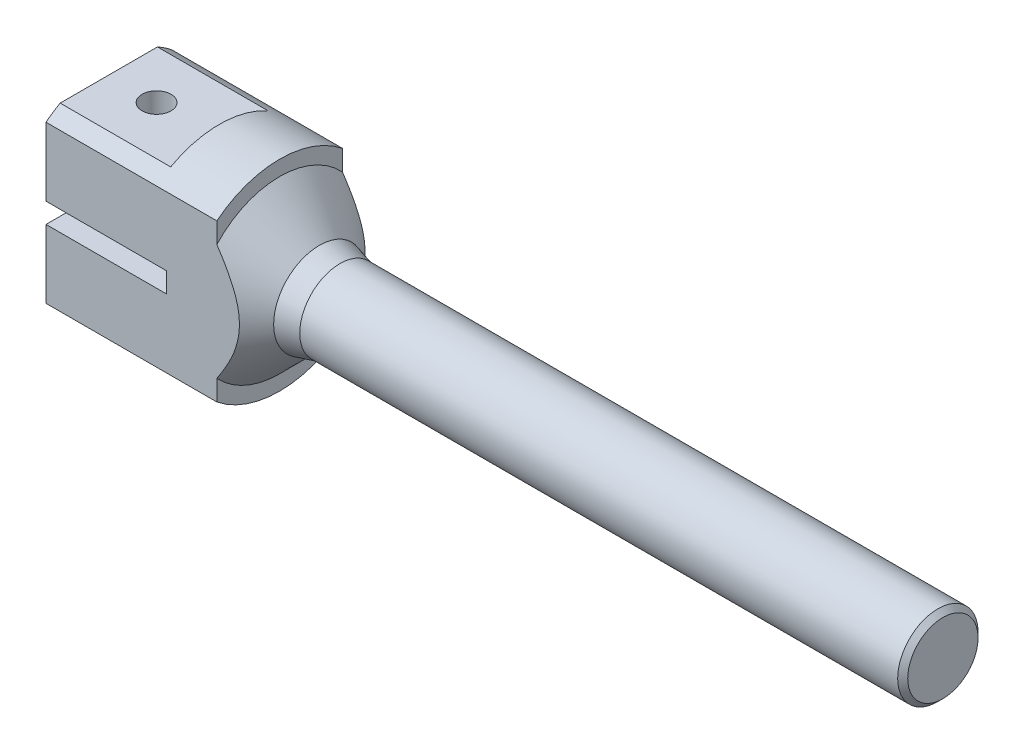
ISO-10303-21;
HEADER;
FILE_DESCRIPTION(('STEP AP214'),'2;1');
FILE_NAME('part.step','',(''),(''),'','','');
FILE_SCHEMA(('AUTOMOTIVE_DESIGN { 1 0 10303 214 1 1 1 1 }'));
ENDSEC;
DATA;
#1=APPLICATION_CONTEXT('core data for automotive mechanical design processes');
#2=APPLICATION_PROTOCOL_DEFINITION('international standard','automotive_design',2000,#1);
#3=PRODUCT_CONTEXT('',#1,'mechanical');
#4=PRODUCT('Part','Part','',(#3));
#5=PRODUCT_RELATED_PRODUCT_CATEGORY('part','',(#4));
#6=PRODUCT_DEFINITION_FORMATION('','',#4);
#7=PRODUCT_DEFINITION_CONTEXT('part definition',#1,'design');
#8=PRODUCT_DEFINITION('design','',#6,#7);
#9=PRODUCT_DEFINITION_SHAPE('','',#8);
#10=(LENGTH_UNIT() NAMED_UNIT(*) SI_UNIT(.MILLI.,.METRE.));
#11=(NAMED_UNIT(*) PLANE_ANGLE_UNIT() SI_UNIT($,.RADIAN.));
#12=(NAMED_UNIT(*) SI_UNIT($,.STERADIAN.) SOLID_ANGLE_UNIT());
#13=UNCERTAINTY_MEASURE_WITH_UNIT(LENGTH_MEASURE(1.E-05),#10,'distance_accuracy_value','');
#14=(GEOMETRIC_REPRESENTATION_CONTEXT(3) GLOBAL_UNCERTAINTY_ASSIGNED_CONTEXT((#13)) GLOBAL_UNIT_ASSIGNED_CONTEXT((#10,
#11,#12)) REPRESENTATION_CONTEXT('',''));
#15=CARTESIAN_POINT('',(0.,0.,0.));
#16=DIRECTION('',(0.,0.,1.));
#17=DIRECTION('',(1.,0.,0.));
#18=AXIS2_PLACEMENT_3D('',#15,#16,#17);
#19=CARTESIAN_POINT('',(-132.,20.,0.));
#20=DIRECTION('',(-1.,0.,0.));
#21=DIRECTION('',(0.,0.,1.));
#22=AXIS2_PLACEMENT_3D('',#19,#20,#21);
#23=PLANE('',#22);
#24=CARTESIAN_POINT('',(-132.,0.,0.));
#25=DIRECTION('',(-1.,0.,0.));
#26=DIRECTION('',(0.,0.,1.));
#27=AXIS2_PLACEMENT_3D('',#24,#25,#26);
#28=CIRCLE('',#27,20.);
#29=CARTESIAN_POINT('',(-132.,-15.612494995996,-12.5));
#30=VERTEX_POINT('',#29);
#31=CARTESIAN_POINT('',(-132.,-15.612494995996,12.5));
#32=VERTEX_POINT('',#31);
#33=EDGE_CURVE('E169',#30,#32,#28,.T.);
#34=ORIENTED_EDGE('',*,*,#33,.F.);
#35=DIRECTION('',(0.,1.,0.));
#36=VECTOR('',#35,1.);
#37=CARTESIAN_POINT('',(-132.,20.,-12.5));
#38=LINE('',#37,#36);
#39=CARTESIAN_POINT('',(-132.,-11.5217186218029,-12.5));
#40=VERTEX_POINT('',#39);
#41=EDGE_CURVE('E142',#30,#40,#38,.T.);
#42=ORIENTED_EDGE('',*,*,#41,.T.);
#43=CARTESIAN_POINT('',(-132.,0.,0.));
#44=DIRECTION('',(-1.,0.,0.));
#45=DIRECTION('',(0.,0.,1.));
#46=AXIS2_PLACEMENT_3D('',#43,#44,#45);
#47=CIRCLE('',#46,17.);
#48=CARTESIAN_POINT('',(-132.,-11.5217186218029,12.5));
#49=VERTEX_POINT('',#48);
#50=EDGE_CURVE('E277',#40,#49,#47,.T.);
#51=ORIENTED_EDGE('',*,*,#50,.T.);
#52=DIRECTION('',(0.,-1.,0.));
#53=VECTOR('',#52,1.);
#54=CARTESIAN_POINT('',(-132.,20.,12.5));
#55=LINE('',#54,#53);
#56=EDGE_CURVE('E212',#49,#32,#55,.T.);
#57=ORIENTED_EDGE('',*,*,#56,.T.);
#58=EDGE_LOOP('',(#34,#42,#51,#57));
#59=FACE_BOUND('',#58,.T.);
#60=ADVANCED_FACE('F37',(#59),#23,.F.);
#61=CARTESIAN_POINT('',(0.,0.,0.));
#62=DIRECTION('',(-1.,0.,0.));
#63=DIRECTION('',(0.,0.,1.));
#64=AXIS2_PLACEMENT_3D('',#61,#62,#63);
#65=CYLINDRICAL_SURFACE('',#64,20.);
#66=CARTESIAN_POINT('',(-132.,15.612494995996,12.5));
#67=VERTEX_POINT('',#66);
#68=CARTESIAN_POINT('',(-132.,15.612494995996,-12.5));
#69=VERTEX_POINT('',#68);
#70=EDGE_CURVE('E282',#67,#69,#28,.T.);
#71=ORIENTED_EDGE('',*,*,#70,.T.);
#72=DIRECTION('',(-1.,0.,0.));
#73=VECTOR('',#72,1.);
#74=CARTESIAN_POINT('',(0.,15.612494995996,-12.5));
#75=LINE('',#74,#73);
#76=CARTESIAN_POINT('',(-166.,15.612494995996,-12.5));
#77=VERTEX_POINT('',#76);
#78=EDGE_CURVE('E246',#69,#77,#75,.T.);
#79=ORIENTED_EDGE('',*,*,#78,.T.);
#80=CARTESIAN_POINT('',(-166.,0.,0.));
#81=DIRECTION('',(-1.,0.,0.));
#82=DIRECTION('',(0.,0.,1.));
#83=AXIS2_PLACEMENT_3D('',#80,#81,#82);
#84=CIRCLE('',#83,20.);
#85=CARTESIAN_POINT('',(-166.,17.5,-9.68245836551854));
#86=VERTEX_POINT('',#85);
#87=EDGE_CURVE('E164',#86,#77,#84,.T.);
#88=ORIENTED_EDGE('',*,*,#87,.F.);
#89=DIRECTION('',(-1.,0.,0.));
#90=VECTOR('',#89,1.);
#91=CARTESIAN_POINT('',(0.,17.5,-9.68245836551854));
#92=LINE('',#91,#90);
#93=CARTESIAN_POINT('',(-144.,17.5,-9.68245836551854));
#94=VERTEX_POINT('',#93);
#95=EDGE_CURVE('E180',#86,#94,#92,.F.);
#96=ORIENTED_EDGE('',*,*,#95,.T.);
#97=CARTESIAN_POINT('',(-144.,0.,0.));
#98=DIRECTION('',(1.,0.,0.));
#99=DIRECTION('',(0.,0.,-1.));
#100=AXIS2_PLACEMENT_3D('',#97,#98,#99);
#101=CIRCLE('',#100,20.);
#102=CARTESIAN_POINT('',(-144.,17.5,9.68245836551854));
#103=VERTEX_POINT('',#102);
#104=EDGE_CURVE('E288',#94,#103,#101,.T.);
#105=ORIENTED_EDGE('',*,*,#104,.T.);
#106=DIRECTION('',(-1.,0.,0.));
#107=VECTOR('',#106,1.);
#108=CARTESIAN_POINT('',(0.,17.5,9.68245836551854));
#109=LINE('',#108,#107);
#110=CARTESIAN_POINT('',(-166.,17.5,9.68245836551854));
#111=VERTEX_POINT('',#110);
#112=EDGE_CURVE('E173',#103,#111,#109,.T.);
#113=ORIENTED_EDGE('',*,*,#112,.T.);
#114=CARTESIAN_POINT('',(-166.,15.612494995996,12.5));
#115=VERTEX_POINT('',#114);
#116=EDGE_CURVE('E167',#115,#111,#84,.T.);
#117=ORIENTED_EDGE('',*,*,#116,.F.);
#118=DIRECTION('',(-1.,0.,0.));
#119=VECTOR('',#118,1.);
#120=CARTESIAN_POINT('',(0.,15.612494995996,12.5));
#121=LINE('',#120,#119);
#122=EDGE_CURVE('E492',#115,#67,#121,.F.);
#123=ORIENTED_EDGE('',*,*,#122,.T.);
#124=EDGE_LOOP('',(#71,#79,#88,#96,#105,#113,#117,#123));
#125=FACE_BOUND('',#124,.T.);
#126=ADVANCED_FACE('F258',(#125),#65,.T.);
#127=CARTESIAN_POINT('',(-166.,20.,0.));
#128=DIRECTION('',(1.,0.,0.));
#129=DIRECTION('',(0.,0.,-1.));
#130=AXIS2_PLACEMENT_3D('',#127,#128,#129);
#131=PLANE('',#130);
#132=ORIENTED_EDGE('',*,*,#87,.T.);
#133=DIRECTION('',(0.,1.,0.));
#134=VECTOR('',#133,1.);
#135=CARTESIAN_POINT('',(-166.,-20.,-12.5));
#136=LINE('',#135,#134);
#137=CARTESIAN_POINT('',(-166.,1.99999999999998,-12.5));
#138=VERTEX_POINT('',#137);
#139=EDGE_CURVE('E158',#138,#77,#136,.T.);
#140=ORIENTED_EDGE('',*,*,#139,.F.);
#141=DIRECTION('',(0.,0.,1.));
#142=VECTOR('',#141,1.);
#143=CARTESIAN_POINT('',(-166.,1.99999999999998,0.));
#144=LINE('',#143,#142);
#145=CARTESIAN_POINT('',(-166.,1.99999999999998,12.5));
#146=VERTEX_POINT('',#145);
#147=EDGE_CURVE('E291',#138,#146,#144,.T.);
#148=ORIENTED_EDGE('',*,*,#147,.T.);
#149=DIRECTION('',(0.,1.,0.));
#150=VECTOR('',#149,1.);
#151=CARTESIAN_POINT('',(-166.,-20.,12.5));
#152=LINE('',#151,#150);
#153=EDGE_CURVE('E498',#146,#115,#152,.T.);
#154=ORIENTED_EDGE('',*,*,#153,.T.);
#155=ORIENTED_EDGE('',*,*,#116,.T.);
#156=DIRECTION('',(0.,0.,-1.));
#157=VECTOR('',#156,1.);
#158=CARTESIAN_POINT('',(-166.,17.5,0.));
#159=LINE('',#158,#157);
#160=EDGE_CURVE('E286',#111,#86,#159,.T.);
#161=ORIENTED_EDGE('',*,*,#160,.T.);
#162=EDGE_LOOP('',(#132,#140,#148,#154,#155,#161));
#163=FACE_BOUND('',#162,.T.);
#164=ADVANCED_FACE('F263',(#163),#131,.F.);
#165=CARTESIAN_POINT('',(0.,0.,0.));
#166=DIRECTION('',(-1.,0.,0.));
#167=DIRECTION('',(0.,0.,1.));
#168=AXIS2_PLACEMENT_3D('',#165,#166,#167);
#169=PLANE('',#168);
#170=CARTESIAN_POINT('',(0.,0.,0.));
#171=DIRECTION('',(-1.,0.,0.));
#172=DIRECTION('',(0.,0.,1.));
#173=AXIS2_PLACEMENT_3D('',#170,#171,#172);
#174=CIRCLE('',#173,7.00000000000002);
#175=CARTESIAN_POINT('',(0.,0.,7.00000000000002));
#176=VERTEX_POINT('',#175);
#177=EDGE_CURVE('E11',#176,#176,#174,.F.);
#178=ORIENTED_EDGE('',*,*,#177,.T.);
#179=EDGE_LOOP('',(#178));
#180=FACE_BOUND('',#179,.T.);
#181=ADVANCED_FACE('F310',(#180),#169,.F.);
#182=CARTESIAN_POINT('',(0.,0.,0.));
#183=DIRECTION('',(-1.,0.,0.));
#184=DIRECTION('',(0.,0.,1.));
#185=AXIS2_PLACEMENT_3D('',#182,#183,#184);
#186=CYLINDRICAL_SURFACE('',#185,7.99999999999999);
#187=CARTESIAN_POINT('',(-0.999999999999961,0.,0.));
#188=DIRECTION('',(-1.,0.,0.));
#189=DIRECTION('',(0.,0.,1.));
#190=AXIS2_PLACEMENT_3D('',#187,#188,#189);
#191=CIRCLE('',#190,7.99999999999999);
#192=CARTESIAN_POINT('',(-0.999999999999961,0.,7.99999999999999));
#193=VERTEX_POINT('',#192);
#194=EDGE_CURVE('E45',#193,#193,#191,.T.);
#195=ORIENTED_EDGE('',*,*,#194,.T.);
#196=EDGE_LOOP('',(#195));
#197=FACE_BOUND('',#196,.T.);
#198=CARTESIAN_POINT('',(-120.,0.,0.));
#199=DIRECTION('',(-1.,0.,0.));
#200=DIRECTION('',(0.,0.,1.));
#201=AXIS2_PLACEMENT_3D('',#198,#199,#200);
#202=CIRCLE('',#201,7.99999999999999);
#203=CARTESIAN_POINT('',(-120.,0.,7.99999999999999));
#204=VERTEX_POINT('',#203);
#205=EDGE_CURVE('E280',#204,#204,#202,.T.);
#206=ORIENTED_EDGE('',*,*,#205,.F.);
#207=EDGE_LOOP('',(#206));
#208=FACE_BOUND('',#207,.T.);
#209=ADVANCED_FACE('F306',(#197,#208),#186,.T.);
#210=CARTESIAN_POINT('',(-120.,0.,0.));
#211=DIRECTION('',(-1.,0.,0.));
#212=DIRECTION('',(0.,0.,1.));
#213=AXIS2_PLACEMENT_3D('',#210,#211,#212);
#214=CONICAL_SURFACE('',#213,7.99999999999999,0.261799387799149);
#215=CARTESIAN_POINT('',(-124.098076211353,0.,0.));
#216=DIRECTION('',(-1.,0.,0.));
#217=DIRECTION('',(0.,0.,1.));
#218=AXIS2_PLACEMENT_3D('',#215,#216,#217);
#219=CIRCLE('',#218,9.09807621135329);
#220=CARTESIAN_POINT('',(-124.098076211353,0.,9.09807621135329));
#221=VERTEX_POINT('',#220);
#222=EDGE_CURVE('E276',#221,#221,#219,.T.);
#223=ORIENTED_EDGE('',*,*,#222,.F.);
#224=EDGE_LOOP('',(#223));
#225=FACE_BOUND('',#224,.T.);
#226=ORIENTED_EDGE('',*,*,#205,.T.);
#227=EDGE_LOOP('',(#226));
#228=FACE_BOUND('',#227,.T.);
#229=ADVANCED_FACE('F233',(#225,#228),#214,.T.);
#230=CARTESIAN_POINT('',(-124.098076211353,0.,0.));
#231=DIRECTION('',(-1.,0.,0.));
#232=DIRECTION('',(0.,0.,1.));
#233=AXIS2_PLACEMENT_3D('',#230,#231,#232);
#234=CONICAL_SURFACE('',#233,9.09807621135329,0.785398163397447);
#235=ORIENTED_EDGE('',*,*,#50,.F.);
#236=CARTESIAN_POINT('',(-142.582505164002,-24.5874885078206,-12.5));
#237=CARTESIAN_POINT('',(-142.329912459532,-24.3041242255394,-12.5));
#238=CARTESIAN_POINT('',(-142.077816178034,-24.0203175125965,-12.5));
#239=CARTESIAN_POINT('',(-141.574724222286,-23.4517278552672,-12.5));
#240=CARTESIAN_POINT('',(-141.323728553534,-23.1669449060179,-12.5));
#241=CARTESIAN_POINT('',(-140.572509072094,-22.3109432741144,-12.5));
#242=CARTESIAN_POINT('',(-140.074102067927,-21.7381270120877,-12.5));
#243=CARTESIAN_POINT('',(-139.081202170822,-20.5849628650982,-12.5));
#244=CARTESIAN_POINT('',(-138.586734070123,-20.0045936013638,-12.5));
#245=CARTESIAN_POINT('',(-137.605368559102,-18.8375271612757,-12.5));
#246=CARTESIAN_POINT('',(-137.118470799965,-18.2508302785989,-12.5));
#247=CARTESIAN_POINT('',(-136.126326363579,-17.0353272930719,-12.5));
#248=CARTESIAN_POINT('',(-135.621652146903,-16.406051669597,-12.5));
#249=CARTESIAN_POINT('',(-134.875311483112,-15.4536941518269,-12.5));
#250=CARTESIAN_POINT('',(-134.628289339896,-15.1348070720314,-12.5));
#251=CARTESIAN_POINT('',(-134.138414100918,-14.4938495911741,-12.5));
#252=CARTESIAN_POINT('',(-133.89556093604,-14.1717792430264,-12.5));
#253=CARTESIAN_POINT('',(-133.415136318841,-13.5245766510037,-12.5));
#254=CARTESIAN_POINT('',(-133.177556501627,-13.1994506252805,-12.5));
#255=CARTESIAN_POINT('',(-132.708121118201,-12.5450994433125,-12.5));
#256=CARTESIAN_POINT('',(-132.476265369085,-12.2158744185509,-12.5));
#257=CARTESIAN_POINT('',(-132.019400181657,-11.5528222598379,-12.5));
#258=CARTESIAN_POINT('',(-131.794389014199,-11.2189963197068,-12.5));
#259=CARTESIAN_POINT('',(-131.352495723505,-10.5460207446593,-12.5));
#260=CARTESIAN_POINT('',(-131.135613000047,-10.2068715054602,-12.5));
#261=CARTESIAN_POINT('',(-130.773695369621,-9.62265647304877,-12.5));
#262=CARTESIAN_POINT('',(-130.62621142329,-9.37910803158632,-12.5));
#263=CARTESIAN_POINT('',(-130.336866991398,-8.88868397830298,-12.5));
#264=CARTESIAN_POINT('',(-130.195006522398,-8.64180835668681,-12.5));
#265=CARTESIAN_POINT('',(-129.917700475652,-8.14435030913598,-12.5));
#266=CARTESIAN_POINT('',(-129.782257299854,-7.89376654060751,-12.5));
#267=CARTESIAN_POINT('',(-129.518831578052,-7.38870084629237,-12.5));
#268=CARTESIAN_POINT('',(-129.390848989258,-7.13421894287371,-12.5));
#269=CARTESIAN_POINT('',(-129.144515414876,-6.62321633491315,-12.5));
#270=CARTESIAN_POINT('',(-129.026093144495,-6.36673021666942,-12.5));
#271=CARTESIAN_POINT('',(-128.798999785147,-5.84948018376722,-12.5));
#272=CARTESIAN_POINT('',(-128.690329447263,-5.58871594143925,-12.5));
#273=CARTESIAN_POINT('',(-128.381215160915,-4.80006408068157,-12.5));
#274=CARTESIAN_POINT('',(-128.197442420802,-4.265360547229,-12.5));
#275=CARTESIAN_POINT('',(-127.938587461919,-3.35838428046543,-12.5));
#276=CARTESIAN_POINT('',(-127.847642537237,-2.99062156549364,-12.5));
#277=CARTESIAN_POINT('',(-127.695516970047,-2.24893926251387,-12.5));
#278=CARTESIAN_POINT('',(-127.634331247564,-1.87502073659379,-12.5));
#279=CARTESIAN_POINT('',(-127.544946982688,-1.12432150052163,-12.5));
#280=CARTESIAN_POINT('',(-127.516652171986,-0.747552408489459,-12.5));
#281=CARTESIAN_POINT('',(-127.4943131528,0.00702119526327052,-12.5));
#282=CARTESIAN_POINT('',(-127.500269123276,0.384825712383575,-12.5));
#283=CARTESIAN_POINT('',(-127.546056730479,1.13781636111397,-12.5));
#284=CARTESIAN_POINT('',(-127.585841475339,1.51300539274105,-12.5));
#285=CARTESIAN_POINT('',(-127.697060799547,2.25861858885501,-12.5));
#286=CARTESIAN_POINT('',(-127.768497789433,2.62904238822501,-12.5));
#287=CARTESIAN_POINT('',(-127.939950415408,3.36464694696357,-12.5));
#288=CARTESIAN_POINT('',(-128.040075962913,3.72980175736228,-12.5));
#289=CARTESIAN_POINT('',(-128.264834560528,4.45239340598112,-12.5));
#290=CARTESIAN_POINT('',(-128.389467636655,4.80983023600706,-12.5));
#291=CARTESIAN_POINT('',(-128.698235536143,5.61862061589263,-12.5));
#292=CARTESIAN_POINT('',(-128.889168301244,6.06736587317811,-12.5));
#293=CARTESIAN_POINT('',(-129.298007455178,6.95249884373674,-12.5));
#294=CARTESIAN_POINT('',(-129.515927941464,7.3888799509199,-12.5));
#295=CARTESIAN_POINT('',(-129.973268938627,8.25122020991313,-12.5));
#296=CARTESIAN_POINT('',(-130.212730165694,8.67715760260757,-12.5));
#297=CARTESIAN_POINT('',(-130.708213487528,9.51912653534905,-12.5));
#298=CARTESIAN_POINT('',(-130.964232830318,9.93515970584469,-12.5));
#299=CARTESIAN_POINT('',(-131.493180370554,10.7646879124833,-12.5));
#300=CARTESIAN_POINT('',(-131.766297998893,11.178061597253,-12.5));
#301=CARTESIAN_POINT('',(-132.323350097896,11.997445029019,-12.5));
#302=CARTESIAN_POINT('',(-132.607284916273,12.4034545386766,-12.5));
#303=CARTESIAN_POINT('',(-133.183546751092,13.2087228694566,-12.5));
#304=CARTESIAN_POINT('',(-133.475863301205,13.6079891983621,-12.5));
#305=CARTESIAN_POINT('',(-133.919680659868,14.2028764454326,-12.5));
#306=CARTESIAN_POINT('',(-134.068508081135,14.4005007486582,-12.5));
#307=CARTESIAN_POINT('',(-134.367788486296,14.7945141309476,-12.5));
#308=CARTESIAN_POINT('',(-134.518241466401,14.990903212888,-12.5));
#309=CARTESIAN_POINT('',(-135.029239690881,15.6527406738963,-12.5));
#310=CARTESIAN_POINT('',(-135.393225678115,16.1155355133311,-12.5));
#311=CARTESIAN_POINT('',(-136.127943701348,17.0357466132561,-12.5));
#312=CARTESIAN_POINT('',(-136.498675956736,17.49316269803,-12.5));
#313=CARTESIAN_POINT('',(-137.245709445989,18.4035119983837,-12.5));
#314=CARTESIAN_POINT('',(-137.622011347707,18.8564446653141,-12.5));
#315=CARTESIAN_POINT('',(-138.379190829643,19.7584566263159,-12.5));
#316=CARTESIAN_POINT('',(-138.760068366539,20.2075359568015,-12.5));
#317=CARTESIAN_POINT('',(-139.525815420376,21.1025908052566,-12.5));
#318=CARTESIAN_POINT('',(-139.910686493325,21.548564990893,-12.5));
#319=CARTESIAN_POINT('',(-140.683683047194,22.4376854653776,-12.5));
#320=CARTESIAN_POINT('',(-141.07180854673,22.8808317380246,-12.5));
#321=CARTESIAN_POINT('',(-142.240338586266,24.2066323407367,-12.5));
#322=CARTESIAN_POINT('',(-143.024886572368,25.0856367093792,-12.5));
#323=CARTESIAN_POINT('',(-144.208653984623,26.3994562108111,-12.5));
#324=CARTESIAN_POINT('',(-144.604801008235,26.8370508519435,-12.5));
#325=CARTESIAN_POINT('',(-145.398904702695,27.7105861183492,-12.5));
#326=CARTESIAN_POINT('',(-145.796861350966,28.1465267641351,-12.5));
#327=CARTESIAN_POINT('',(-146.993117907138,29.4521896937749,-12.5));
#328=CARTESIAN_POINT('',(-147.793790770945,30.3197378463011,-12.5));
#329=CARTESIAN_POINT('',(-149.399864489899,32.050024919012,-12.5));
#330=CARTESIAN_POINT('',(-150.205264074315,32.9127650202052,-12.5));
#331=CARTESIAN_POINT('',(-151.820001056577,34.6345429733566,-12.5));
#332=CARTESIAN_POINT('',(-152.629338437169,35.4935808415052,-12.5));
#333=CARTESIAN_POINT('',(-154.870339327525,37.8633977717932,-12.5));
#334=CARTESIAN_POINT('',(-156.305350624908,39.3710102980744,-12.5));
#335=CARTESIAN_POINT('',(-159.182484336396,42.3796467413485,-12.5));
#336=CARTESIAN_POINT('',(-160.624607289065,43.8806701425586,-12.5));
#337=CARTESIAN_POINT('',(-163.50906807521,46.8725603224486,-12.5));
#338=CARTESIAN_POINT('',(-164.951388099977,48.3634442773318,-12.5));
#339=CARTESIAN_POINT('',(-167.117742705545,50.5968542784499,-12.5));
#340=CARTESIAN_POINT('',(-167.840308600896,51.3408060870532,-12.5));
#341=CARTESIAN_POINT('',(-169.286308153613,52.8278649098813,-12.5));
#342=CARTESIAN_POINT('',(-170.009741810359,53.5709719247096,-12.5));
#343=CARTESIAN_POINT('',(-170.73355429671,54.3137098212256,-12.5));
#344=B_SPLINE_CURVE_WITH_KNOTS('',3,(#236,#237,#238,#239,#240,#241,#242,#243,#244,#245,#246,
#247,#248,#249,#250,#251,#252,#253,#254,#255,#256,#257,#258,#259,#260,#261,#262,#263,#264,#265,
#266,#267,#268,#269,#270,#271,#272,#273,#274,#275,#276,#277,#278,#279,#280,#281,#282,#283,#284,
#285,#286,#287,#288,#289,#290,#291,#292,#293,#294,#295,#296,#297,#298,#299,#300,#301,#302,#303,
#304,#305,#306,#307,#308,#309,#310,#311,#312,#313,#314,#315,#316,#317,#318,#319,#320,#321,#322,
#323,#324,#325,#326,#327,#328,#329,#330,#331,#332,#333,#334,#335,#336,#337,#338,#339,#340,#341,
#342,#343),.UNSPECIFIED.,.F.,.F.,(4,2,2,2,2,2,2,2,2,2,2,2,2,2,2,2,2,2,2,2,2,2,2,2,2,2,2,2,2,2,2,
2,2,2,2,2,2,2,2,2,2,2,2,2,2,2,2,2,2,2,2,2,2,4),(0.,1.1388078034594,2.27762128804384,
4.55547025978992,6.84276236047884,9.1299487565436,11.5497183812274,12.7598071460397,
13.9698758297192,15.1778635207777,16.3858125626454,17.5934538625367,18.8010058113829,
19.6551125618412,20.5092218273567,21.3636482945591,22.2180698607832,23.065381601155,
23.9127585445233,25.6059881659704,26.7414941819285,27.8768062958662,29.008787034134,
30.1407736869643,31.2711937858895,32.4016999889513,33.5365966591332,34.6714945341756,
36.1333348813379,37.5959420900476,39.0613744580908,40.5265638924005,42.0127036507536,
43.4988912207943,44.9832975240624,45.7254798992265,46.4676605454252,48.2339199669056,
50.0002369301062,51.7667674350425,53.5332812278315,55.3005112884846,57.0677514645852,
60.6022782772259,62.3730929132289,64.1438855156707,67.6855318478711,71.2262660801863,
74.7669848125395,81.0110962651543,87.2556880759125,93.4787960195283,96.5900801196453,
99.70136199629),.UNSPECIFIED.);
#345=CARTESIAN_POINT('',(-132.,11.5217186218029,-12.5));
#346=VERTEX_POINT('',#345);
#347=EDGE_CURVE('E239',#40,#346,#344,.T.);
#348=ORIENTED_EDGE('',*,*,#347,.T.);
#349=CARTESIAN_POINT('',(-132.,11.5217186218029,12.5));
#350=VERTEX_POINT('',#349);
#351=EDGE_CURVE('E273',#350,#346,#47,.T.);
#352=ORIENTED_EDGE('',*,*,#351,.F.);
#353=CARTESIAN_POINT('',(-142.582505164002,-24.5874885078206,12.5));
#354=CARTESIAN_POINT('',(-142.329912459532,-24.3041242255394,12.5));
#355=CARTESIAN_POINT('',(-142.077816178034,-24.0203175125965,12.5));
#356=CARTESIAN_POINT('',(-141.574724222286,-23.4517278552672,12.5));
#357=CARTESIAN_POINT('',(-141.323728553534,-23.1669449060179,12.5));
#358=CARTESIAN_POINT('',(-140.572509072094,-22.3109432741144,12.5));
#359=CARTESIAN_POINT('',(-140.074102067927,-21.7381270120877,12.5));
#360=CARTESIAN_POINT('',(-139.081202170822,-20.5849628650982,12.5));
#361=CARTESIAN_POINT('',(-138.586734070123,-20.0045936013638,12.5));
#362=CARTESIAN_POINT('',(-137.605368559102,-18.8375271612757,12.5));
#363=CARTESIAN_POINT('',(-137.118470799965,-18.2508302785989,12.5));
#364=CARTESIAN_POINT('',(-136.126326363579,-17.0353272930719,12.5));
#365=CARTESIAN_POINT('',(-135.621652146903,-16.406051669597,12.5));
#366=CARTESIAN_POINT('',(-134.875311483112,-15.4536941518269,12.5));
#367=CARTESIAN_POINT('',(-134.628289339896,-15.1348070720314,12.5));
#368=CARTESIAN_POINT('',(-134.138414100918,-14.4938495911741,12.5));
#369=CARTESIAN_POINT('',(-133.89556093604,-14.1717792430264,12.5));
#370=CARTESIAN_POINT('',(-133.415136318841,-13.5245766510037,12.5));
#371=CARTESIAN_POINT('',(-133.177556501627,-13.1994506252805,12.5));
#372=CARTESIAN_POINT('',(-132.708121118201,-12.5450994433125,12.5));
#373=CARTESIAN_POINT('',(-132.476265369085,-12.2158744185509,12.5));
#374=CARTESIAN_POINT('',(-132.019400181657,-11.5528222598379,12.5));
#375=CARTESIAN_POINT('',(-131.794389014199,-11.2189963197068,12.5));
#376=CARTESIAN_POINT('',(-131.352495723505,-10.5460207446593,12.5));
#377=CARTESIAN_POINT('',(-131.135613000047,-10.2068715054602,12.5));
#378=CARTESIAN_POINT('',(-130.773695369621,-9.62265647304877,12.5));
#379=CARTESIAN_POINT('',(-130.62621142329,-9.37910803158632,12.5));
#380=CARTESIAN_POINT('',(-130.336866991398,-8.88868397830298,12.5));
#381=CARTESIAN_POINT('',(-130.195006522398,-8.64180835668681,12.5));
#382=CARTESIAN_POINT('',(-129.917700475652,-8.14435030913598,12.5));
#383=CARTESIAN_POINT('',(-129.782257299854,-7.89376654060751,12.5));
#384=CARTESIAN_POINT('',(-129.518831578052,-7.38870084629237,12.5));
#385=CARTESIAN_POINT('',(-129.390848989258,-7.13421894287371,12.5));
#386=CARTESIAN_POINT('',(-129.144515414876,-6.62321633491315,12.5));
#387=CARTESIAN_POINT('',(-129.026093144495,-6.36673021666942,12.5));
#388=CARTESIAN_POINT('',(-128.798999785147,-5.84948018376722,12.5));
#389=CARTESIAN_POINT('',(-128.690329447263,-5.58871594143925,12.5));
#390=CARTESIAN_POINT('',(-128.381215160915,-4.80006408068157,12.5));
#391=CARTESIAN_POINT('',(-128.197442420802,-4.265360547229,12.5));
#392=CARTESIAN_POINT('',(-127.938587461919,-3.35838428046543,12.5));
#393=CARTESIAN_POINT('',(-127.847642537237,-2.99062156549364,12.5));
#394=CARTESIAN_POINT('',(-127.695516970047,-2.24893926251387,12.5));
#395=CARTESIAN_POINT('',(-127.634331247564,-1.87502073659379,12.5));
#396=CARTESIAN_POINT('',(-127.544946982688,-1.12432150052163,12.5));
#397=CARTESIAN_POINT('',(-127.516652171986,-0.747552408489459,12.5));
#398=CARTESIAN_POINT('',(-127.4943131528,0.00702119526327052,12.5));
#399=CARTESIAN_POINT('',(-127.500269123276,0.384825712383575,12.5));
#400=CARTESIAN_POINT('',(-127.546056730479,1.13781636111397,12.5));
#401=CARTESIAN_POINT('',(-127.585841475339,1.51300539274105,12.5));
#402=CARTESIAN_POINT('',(-127.697060799547,2.25861858885501,12.5));
#403=CARTESIAN_POINT('',(-127.768497789433,2.62904238822501,12.5));
#404=CARTESIAN_POINT('',(-127.939950415408,3.36464694696357,12.5));
#405=CARTESIAN_POINT('',(-128.040075962913,3.72980175736228,12.5));
#406=CARTESIAN_POINT('',(-128.264834560528,4.45239340598112,12.5));
#407=CARTESIAN_POINT('',(-128.389467636655,4.80983023600706,12.5));
#408=CARTESIAN_POINT('',(-128.698235536143,5.61862061589263,12.5));
#409=CARTESIAN_POINT('',(-128.889168301244,6.06736587317811,12.5));
#410=CARTESIAN_POINT('',(-129.298007455178,6.95249884373674,12.5));
#411=CARTESIAN_POINT('',(-129.515927941464,7.3888799509199,12.5));
#412=CARTESIAN_POINT('',(-129.973268938627,8.25122020991313,12.5));
#413=CARTESIAN_POINT('',(-130.212730165694,8.67715760260757,12.5));
#414=CARTESIAN_POINT('',(-130.708213487528,9.51912653534905,12.5));
#415=CARTESIAN_POINT('',(-130.964232830318,9.93515970584469,12.5));
#416=CARTESIAN_POINT('',(-131.493180370554,10.7646879124833,12.5));
#417=CARTESIAN_POINT('',(-131.766297998893,11.178061597253,12.5));
#418=CARTESIAN_POINT('',(-132.323350097896,11.997445029019,12.5));
#419=CARTESIAN_POINT('',(-132.607284916273,12.4034545386766,12.5));
#420=CARTESIAN_POINT('',(-133.183546751092,13.2087228694566,12.5));
#421=CARTESIAN_POINT('',(-133.475863301205,13.6079891983621,12.5));
#422=CARTESIAN_POINT('',(-133.919680659868,14.2028764454326,12.5));
#423=CARTESIAN_POINT('',(-134.068508081135,14.4005007486582,12.5));
#424=CARTESIAN_POINT('',(-134.367788486296,14.7945141309476,12.5));
#425=CARTESIAN_POINT('',(-134.518241466401,14.990903212888,12.5));
#426=CARTESIAN_POINT('',(-135.029239690881,15.6527406738963,12.5));
#427=CARTESIAN_POINT('',(-135.393225678115,16.1155355133311,12.5));
#428=CARTESIAN_POINT('',(-136.127943701348,17.0357466132561,12.5));
#429=CARTESIAN_POINT('',(-136.498675956736,17.49316269803,12.5));
#430=CARTESIAN_POINT('',(-137.245709445989,18.4035119983837,12.5));
#431=CARTESIAN_POINT('',(-137.622011347707,18.8564446653141,12.5));
#432=CARTESIAN_POINT('',(-138.379190829643,19.7584566263159,12.5));
#433=CARTESIAN_POINT('',(-138.760068366539,20.2075359568015,12.5));
#434=CARTESIAN_POINT('',(-139.525815420376,21.1025908052566,12.5));
#435=CARTESIAN_POINT('',(-139.910686493325,21.548564990893,12.5));
#436=CARTESIAN_POINT('',(-140.683683047194,22.4376854653776,12.5));
#437=CARTESIAN_POINT('',(-141.07180854673,22.8808317380246,12.5));
#438=CARTESIAN_POINT('',(-142.240338586266,24.2066323407367,12.5));
#439=CARTESIAN_POINT('',(-143.024886572368,25.0856367093792,12.5));
#440=CARTESIAN_POINT('',(-144.208653984623,26.3994562108111,12.5));
#441=CARTESIAN_POINT('',(-144.604801008235,26.8370508519435,12.5));
#442=CARTESIAN_POINT('',(-145.398904702695,27.7105861183492,12.5));
#443=CARTESIAN_POINT('',(-145.796861350966,28.1465267641351,12.5));
#444=CARTESIAN_POINT('',(-146.993117907138,29.4521896937749,12.5));
#445=CARTESIAN_POINT('',(-147.793790770945,30.3197378463011,12.5));
#446=CARTESIAN_POINT('',(-149.399864489899,32.050024919012,12.5));
#447=CARTESIAN_POINT('',(-150.205264074315,32.9127650202052,12.5));
#448=CARTESIAN_POINT('',(-151.820001056577,34.6345429733566,12.5));
#449=CARTESIAN_POINT('',(-152.629338437169,35.4935808415052,12.5));
#450=CARTESIAN_POINT('',(-154.870339327525,37.8633977717932,12.5));
#451=CARTESIAN_POINT('',(-156.305350624908,39.3710102980744,12.5));
#452=CARTESIAN_POINT('',(-159.182484336396,42.3796467413485,12.5));
#453=CARTESIAN_POINT('',(-160.624607289065,43.8806701425586,12.5));
#454=CARTESIAN_POINT('',(-163.50906807521,46.8725603224486,12.5));
#455=CARTESIAN_POINT('',(-164.951388099977,48.3634442773318,12.5));
#456=CARTESIAN_POINT('',(-167.117742705545,50.5968542784499,12.5));
#457=CARTESIAN_POINT('',(-167.840308600896,51.3408060870532,12.5));
#458=CARTESIAN_POINT('',(-169.286308153613,52.8278649098813,12.5));
#459=CARTESIAN_POINT('',(-170.009741810359,53.5709719247096,12.5));
#460=CARTESIAN_POINT('',(-170.73355429671,54.3137098212256,12.5));
#461=B_SPLINE_CURVE_WITH_KNOTS('',3,(#353,#354,#355,#356,#357,#358,#359,#360,#361,#362,#363,
#364,#365,#366,#367,#368,#369,#370,#371,#372,#373,#374,#375,#376,#377,#378,#379,#380,#381,#382,
#383,#384,#385,#386,#387,#388,#389,#390,#391,#392,#393,#394,#395,#396,#397,#398,#399,#400,#401,
#402,#403,#404,#405,#406,#407,#408,#409,#410,#411,#412,#413,#414,#415,#416,#417,#418,#419,#420,
#421,#422,#423,#424,#425,#426,#427,#428,#429,#430,#431,#432,#433,#434,#435,#436,#437,#438,#439,
#440,#441,#442,#443,#444,#445,#446,#447,#448,#449,#450,#451,#452,#453,#454,#455,#456,#457,#458,
#459,#460),.UNSPECIFIED.,.F.,.F.,(4,2,2,2,2,2,2,2,2,2,2,2,2,2,2,2,2,2,2,2,2,2,2,2,2,2,2,2,2,2,2,
2,2,2,2,2,2,2,2,2,2,2,2,2,2,2,2,2,2,2,2,2,2,4),(0.,1.1388078034594,2.27762128804384,
4.55547025978992,6.84276236047884,9.1299487565436,11.5497183812274,12.7598071460397,
13.9698758297192,15.1778635207777,16.3858125626454,17.5934538625367,18.8010058113829,
19.6551125618412,20.5092218273567,21.3636482945591,22.2180698607832,23.065381601155,
23.9127585445233,25.6059881659704,26.7414941819285,27.8768062958662,29.008787034134,
30.1407736869643,31.2711937858895,32.4016999889513,33.5365966591332,34.6714945341756,
36.1333348813379,37.5959420900476,39.0613744580908,40.5265638924005,42.0127036507536,
43.4988912207943,44.9832975240624,45.7254798992265,46.4676605454252,48.2339199669056,
50.0002369301062,51.7667674350425,53.5332812278315,55.3005112884846,57.0677514645852,
60.6022782772259,62.3730929132289,64.1438855156707,67.6855318478711,71.2262660801863,
74.7669848125395,81.0110962651543,87.2556880759125,93.4787960195283,96.5900801196453,
99.70136199629),.UNSPECIFIED.);
#462=EDGE_CURVE('E213',#350,#49,#461,.F.);
#463=ORIENTED_EDGE('',*,*,#462,.T.);
#464=EDGE_LOOP('',(#235,#348,#352,#463));
#465=FACE_BOUND('',#464,.T.);
#466=ORIENTED_EDGE('',*,*,#222,.T.);
#467=EDGE_LOOP('',(#466));
#468=FACE_BOUND('',#467,.T.);
#469=ADVANCED_FACE('F227',(#465,#468),#234,.T.);
#470=ORIENTED_EDGE('',*,*,#351,.T.);
#471=EDGE_CURVE('E245',#346,#69,#38,.T.);
#472=ORIENTED_EDGE('',*,*,#471,.T.);
#473=ORIENTED_EDGE('',*,*,#70,.F.);
#474=EDGE_CURVE('E221',#67,#350,#55,.T.);
#475=ORIENTED_EDGE('',*,*,#474,.T.);
#476=EDGE_LOOP('',(#470,#472,#473,#475));
#477=FACE_BOUND('',#476,.T.);
#478=ADVANCED_FACE('F232',(#477),#23,.F.);
#479=CARTESIAN_POINT('',(-166.,-15.612494995996,-12.5));
#480=VERTEX_POINT('',#479);
#481=CARTESIAN_POINT('',(-166.,-17.5,-9.68245836551854));
#482=VERTEX_POINT('',#481);
#483=EDGE_CURVE('E152',#480,#482,#84,.T.);
#484=ORIENTED_EDGE('',*,*,#483,.F.);
#485=DIRECTION('',(-1.,0.,0.));
#486=VECTOR('',#485,1.);
#487=CARTESIAN_POINT('',(0.,-15.612494995996,-12.5));
#488=LINE('',#487,#486);
#489=EDGE_CURVE('E138',#480,#30,#488,.F.);
#490=ORIENTED_EDGE('',*,*,#489,.T.);
#491=ORIENTED_EDGE('',*,*,#33,.T.);
#492=DIRECTION('',(-1.,0.,0.));
#493=VECTOR('',#492,1.);
#494=CARTESIAN_POINT('',(0.,-15.612494995996,12.5));
#495=LINE('',#494,#493);
#496=CARTESIAN_POINT('',(-166.,-15.612494995996,12.5));
#497=VERTEX_POINT('',#496);
#498=EDGE_CURVE('E209',#32,#497,#495,.T.);
#499=ORIENTED_EDGE('',*,*,#498,.T.);
#500=CARTESIAN_POINT('',(-166.,-17.5,9.68245836551854));
#501=VERTEX_POINT('',#500);
#502=EDGE_CURVE('E165',#501,#497,#84,.T.);
#503=ORIENTED_EDGE('',*,*,#502,.F.);
#504=DIRECTION('',(-1.,0.,0.));
#505=VECTOR('',#504,1.);
#506=CARTESIAN_POINT('',(0.,-17.5,9.68245836551854));
#507=LINE('',#506,#505);
#508=CARTESIAN_POINT('',(-144.,-17.5,9.68245836551854));
#509=VERTEX_POINT('',#508);
#510=EDGE_CURVE('E193',#501,#509,#507,.F.);
#511=ORIENTED_EDGE('',*,*,#510,.T.);
#512=CARTESIAN_POINT('',(-144.,0.,0.));
#513=DIRECTION('',(1.,0.,0.));
#514=DIRECTION('',(0.,0.,-1.));
#515=AXIS2_PLACEMENT_3D('',#512,#513,#514);
#516=CIRCLE('',#515,20.);
#517=CARTESIAN_POINT('',(-144.,-17.5,-9.68245836551854));
#518=VERTEX_POINT('',#517);
#519=EDGE_CURVE('E295',#509,#518,#516,.T.);
#520=ORIENTED_EDGE('',*,*,#519,.T.);
#521=DIRECTION('',(-1.,0.,0.));
#522=VECTOR('',#521,1.);
#523=CARTESIAN_POINT('',(0.,-17.5,-9.68245836551854));
#524=LINE('',#523,#522);
#525=EDGE_CURVE('E163',#518,#482,#524,.T.);
#526=ORIENTED_EDGE('',*,*,#525,.T.);
#527=EDGE_LOOP('',(#484,#490,#491,#499,#503,#511,#520,#526));
#528=FACE_BOUND('',#527,.T.);
#529=ADVANCED_FACE('F161',(#528),#65,.T.);
#530=DIRECTION('',(0.,0.,-1.));
#531=VECTOR('',#530,1.);
#532=CARTESIAN_POINT('',(-166.,-2.00000000000002,0.));
#533=LINE('',#532,#531);
#534=CARTESIAN_POINT('',(-166.,-2.00000000000002,12.5));
#535=VERTEX_POINT('',#534);
#536=CARTESIAN_POINT('',(-166.,-2.00000000000002,-12.5));
#537=VERTEX_POINT('',#536);
#538=EDGE_CURVE('E156',#535,#537,#533,.T.);
#539=ORIENTED_EDGE('',*,*,#538,.T.);
#540=EDGE_CURVE('E52',#480,#537,#136,.T.);
#541=ORIENTED_EDGE('',*,*,#540,.F.);
#542=ORIENTED_EDGE('',*,*,#483,.T.);
#543=DIRECTION('',(0.,0.,1.));
#544=VECTOR('',#543,1.);
#545=CARTESIAN_POINT('',(-166.,-17.5,0.));
#546=LINE('',#545,#544);
#547=EDGE_CURVE('E293',#482,#501,#546,.T.);
#548=ORIENTED_EDGE('',*,*,#547,.T.);
#549=ORIENTED_EDGE('',*,*,#502,.T.);
#550=EDGE_CURVE('E496',#497,#535,#152,.T.);
#551=ORIENTED_EDGE('',*,*,#550,.T.);
#552=EDGE_LOOP('',(#539,#541,#542,#548,#549,#551));
#553=FACE_BOUND('',#552,.T.);
#554=ADVANCED_FACE('F150',(#553),#131,.F.);
#555=CARTESIAN_POINT('',(-144.,20.,-50.));
#556=DIRECTION('',(1.,0.,0.));
#557=DIRECTION('',(0.,0.,-1.));
#558=AXIS2_PLACEMENT_3D('',#555,#556,#557);
#559=PLANE('',#558);
#560=DIRECTION('',(0.,0.,1.));
#561=VECTOR('',#560,1.);
#562=CARTESIAN_POINT('',(-144.,17.5,-50.));
#563=LINE('',#562,#561);
#564=EDGE_CURVE('E184',#94,#103,#563,.T.);
#565=ORIENTED_EDGE('',*,*,#564,.T.);
#566=ORIENTED_EDGE('',*,*,#104,.F.);
#567=EDGE_LOOP('',(#565,#566));
#568=FACE_BOUND('',#567,.T.);
#569=ADVANCED_FACE('F353',(#568),#559,.F.);
#570=CARTESIAN_POINT('',(-166.,17.5,-50.));
#571=DIRECTION('',(0.,-1.,0.));
#572=DIRECTION('',(0.,0.,-1.));
#573=AXIS2_PLACEMENT_3D('',#570,#571,#572);
#574=PLANE('',#573);
#575=CARTESIAN_POINT('',(-156.5,17.5,0.));
#576=DIRECTION('',(0.,1.,0.));
#577=DIRECTION('',(0.,0.,1.));
#578=AXIS2_PLACEMENT_3D('',#575,#576,#577);
#579=CIRCLE('',#578,2.87499999999999);
#580=CARTESIAN_POINT('',(-156.5,17.5,2.87499999999999));
#581=VERTEX_POINT('',#580);
#582=EDGE_CURVE('E206',#581,#581,#579,.T.);
#583=ORIENTED_EDGE('',*,*,#582,.F.);
#584=EDGE_LOOP('',(#583));
#585=FACE_BOUND('',#584,.T.);
#586=ORIENTED_EDGE('',*,*,#564,.F.);
#587=ORIENTED_EDGE('',*,*,#95,.F.);
#588=ORIENTED_EDGE('',*,*,#160,.F.);
#589=ORIENTED_EDGE('',*,*,#112,.F.);
#590=EDGE_LOOP('',(#586,#587,#588,#589));
#591=FACE_BOUND('',#590,.T.);
#592=ADVANCED_FACE('F359',(#585,#591),#574,.F.);
#593=CARTESIAN_POINT('',(-142.,1.99999999999998,-50.));
#594=DIRECTION('',(1.,0.,0.));
#595=DIRECTION('',(0.,0.,-1.));
#596=AXIS2_PLACEMENT_3D('',#593,#594,#595);
#597=PLANE('',#596);
#598=DIRECTION('',(0.,0.,1.));
#599=VECTOR('',#598,1.);
#600=CARTESIAN_POINT('',(-142.,1.99999999999998,-50.));
#601=LINE('',#600,#599);
#602=CARTESIAN_POINT('',(-142.,1.99999999999998,-12.5));
#603=VERTEX_POINT('',#602);
#604=CARTESIAN_POINT('',(-142.,1.99999999999998,12.5));
#605=VERTEX_POINT('',#604);
#606=EDGE_CURVE('E189',#603,#605,#601,.T.);
#607=ORIENTED_EDGE('',*,*,#606,.F.);
#608=DIRECTION('',(0.,-1.,0.));
#609=VECTOR('',#608,1.);
#610=CARTESIAN_POINT('',(-142.,1.99999999999998,-12.5));
#611=LINE('',#610,#609);
#612=CARTESIAN_POINT('',(-142.,-2.00000000000002,-12.5));
#613=VERTEX_POINT('',#612);
#614=EDGE_CURVE('E157',#603,#613,#611,.T.);
#615=ORIENTED_EDGE('',*,*,#614,.T.);
#616=DIRECTION('',(0.,0.,1.));
#617=VECTOR('',#616,1.);
#618=CARTESIAN_POINT('',(-142.,-2.00000000000002,-50.));
#619=LINE('',#618,#617);
#620=CARTESIAN_POINT('',(-142.,-2.00000000000002,12.5));
#621=VERTEX_POINT('',#620);
#622=EDGE_CURVE('E60',#613,#621,#619,.T.);
#623=ORIENTED_EDGE('',*,*,#622,.T.);
#624=DIRECTION('',(0.,1.,0.));
#625=VECTOR('',#624,1.);
#626=CARTESIAN_POINT('',(-142.,1.99999999999998,12.5));
#627=LINE('',#626,#625);
#628=EDGE_CURVE('E493',#621,#605,#627,.T.);
#629=ORIENTED_EDGE('',*,*,#628,.T.);
#630=EDGE_LOOP('',(#607,#615,#623,#629));
#631=FACE_BOUND('',#630,.T.);
#632=ADVANCED_FACE('F364',(#631),#597,.F.);
#633=CARTESIAN_POINT('',(-166.,1.99999999999998,-50.));
#634=DIRECTION('',(0.,1.,0.));
#635=DIRECTION('',(-1.,0.,0.));
#636=AXIS2_PLACEMENT_3D('',#633,#634,#635);
#637=PLANE('',#636);
#638=CARTESIAN_POINT('',(-156.5,1.99999999999998,0.));
#639=DIRECTION('',(0.,1.,0.));
#640=DIRECTION('',(-1.,0.,0.));
#641=AXIS2_PLACEMENT_3D('',#638,#639,#640);
#642=CIRCLE('',#641,2.87499999999999);
#643=CARTESIAN_POINT('',(-159.375,1.99999999999998,0.));
#644=VERTEX_POINT('',#643);
#645=EDGE_CURVE('E199',#644,#644,#642,.T.);
#646=ORIENTED_EDGE('',*,*,#645,.T.);
#647=EDGE_LOOP('',(#646));
#648=FACE_BOUND('',#647,.T.);
#649=ORIENTED_EDGE('',*,*,#147,.F.);
#650=DIRECTION('',(1.,0.,0.));
#651=VECTOR('',#650,1.);
#652=CARTESIAN_POINT('',(-166.,1.99999999999998,-12.5));
#653=LINE('',#652,#651);
#654=EDGE_CURVE('E146',#138,#603,#653,.T.);
#655=ORIENTED_EDGE('',*,*,#654,.T.);
#656=ORIENTED_EDGE('',*,*,#606,.T.);
#657=DIRECTION('',(-1.,0.,0.));
#658=VECTOR('',#657,1.);
#659=CARTESIAN_POINT('',(-166.,1.99999999999998,12.5));
#660=LINE('',#659,#658);
#661=EDGE_CURVE('E491',#605,#146,#660,.T.);
#662=ORIENTED_EDGE('',*,*,#661,.T.);
#663=EDGE_LOOP('',(#649,#655,#656,#662));
#664=FACE_BOUND('',#663,.T.);
#665=ADVANCED_FACE('F375',(#648,#664),#637,.F.);
#666=CARTESIAN_POINT('',(-166.,-2.00000000000002,-50.));
#667=DIRECTION('',(0.,-1.,0.));
#668=DIRECTION('',(1.,0.,0.));
#669=AXIS2_PLACEMENT_3D('',#666,#667,#668);
#670=PLANE('',#669);
#671=CARTESIAN_POINT('',(-156.5,-2.00000000000002,0.));
#672=DIRECTION('',(0.,-1.,0.));
#673=DIRECTION('',(1.,0.,0.));
#674=AXIS2_PLACEMENT_3D('',#671,#672,#673);
#675=CIRCLE('',#674,2.87499999999999);
#676=CARTESIAN_POINT('',(-153.625,-2.00000000000002,0.));
#677=VERTEX_POINT('',#676);
#678=EDGE_CURVE('E202',#677,#677,#675,.T.);
#679=ORIENTED_EDGE('',*,*,#678,.T.);
#680=EDGE_LOOP('',(#679));
#681=FACE_BOUND('',#680,.T.);
#682=ORIENTED_EDGE('',*,*,#622,.F.);
#683=DIRECTION('',(-1.,0.,0.));
#684=VECTOR('',#683,1.);
#685=CARTESIAN_POINT('',(-166.,-2.00000000000002,-12.5));
#686=LINE('',#685,#684);
#687=EDGE_CURVE('E302',#613,#537,#686,.T.);
#688=ORIENTED_EDGE('',*,*,#687,.T.);
#689=ORIENTED_EDGE('',*,*,#538,.F.);
#690=DIRECTION('',(1.,0.,0.));
#691=VECTOR('',#690,1.);
#692=CARTESIAN_POINT('',(-166.,-2.00000000000002,12.5));
#693=LINE('',#692,#691);
#694=EDGE_CURVE('E297',#535,#621,#693,.T.);
#695=ORIENTED_EDGE('',*,*,#694,.T.);
#696=EDGE_LOOP('',(#682,#688,#689,#695));
#697=FACE_BOUND('',#696,.T.);
#698=ADVANCED_FACE('F384',(#681,#697),#670,.F.);
#699=CARTESIAN_POINT('',(-144.,-17.5,-50.));
#700=DIRECTION('',(1.,0.,0.));
#701=DIRECTION('',(0.,0.,-1.));
#702=AXIS2_PLACEMENT_3D('',#699,#700,#701);
#703=PLANE('',#702);
#704=DIRECTION('',(0.,0.,1.));
#705=VECTOR('',#704,1.);
#706=CARTESIAN_POINT('',(-144.,-17.5,-50.));
#707=LINE('',#706,#705);
#708=EDGE_CURVE('E196',#518,#509,#707,.T.);
#709=ORIENTED_EDGE('',*,*,#708,.F.);
#710=ORIENTED_EDGE('',*,*,#519,.F.);
#711=EDGE_LOOP('',(#709,#710));
#712=FACE_BOUND('',#711,.T.);
#713=ADVANCED_FACE('F394',(#712),#703,.F.);
#714=CARTESIAN_POINT('',(-166.,-17.5,-50.));
#715=DIRECTION('',(0.,1.,0.));
#716=DIRECTION('',(0.,0.,1.));
#717=AXIS2_PLACEMENT_3D('',#714,#715,#716);
#718=PLANE('',#717);
#719=CARTESIAN_POINT('',(-156.5,-17.5,0.));
#720=DIRECTION('',(0.,1.,0.));
#721=DIRECTION('',(0.,0.,1.));
#722=AXIS2_PLACEMENT_3D('',#719,#720,#721);
#723=CIRCLE('',#722,2.87499999999999);
#724=CARTESIAN_POINT('',(-156.5,-17.5,2.87499999999999));
#725=VERTEX_POINT('',#724);
#726=EDGE_CURVE('E205',#725,#725,#723,.T.);
#727=ORIENTED_EDGE('',*,*,#726,.T.);
#728=EDGE_LOOP('',(#727));
#729=FACE_BOUND('',#728,.T.);
#730=ORIENTED_EDGE('',*,*,#708,.T.);
#731=ORIENTED_EDGE('',*,*,#510,.F.);
#732=ORIENTED_EDGE('',*,*,#547,.F.);
#733=ORIENTED_EDGE('',*,*,#525,.F.);
#734=EDGE_LOOP('',(#730,#731,#732,#733));
#735=FACE_BOUND('',#734,.T.);
#736=ADVANCED_FACE('F402',(#729,#735),#718,.F.);
#737=CARTESIAN_POINT('',(-156.5,-20.,0.));
#738=DIRECTION('',(0.,1.,0.));
#739=DIRECTION('',(0.,0.,1.));
#740=AXIS2_PLACEMENT_3D('',#737,#738,#739);
#741=CYLINDRICAL_SURFACE('',#740,2.87499999999999);
#742=ORIENTED_EDGE('',*,*,#726,.F.);
#743=EDGE_LOOP('',(#742));
#744=FACE_BOUND('',#743,.T.);
#745=ORIENTED_EDGE('',*,*,#678,.F.);
#746=EDGE_LOOP('',(#745));
#747=FACE_BOUND('',#746,.T.);
#748=ADVANCED_FACE('F407',(#744,#747),#741,.F.);
#749=ORIENTED_EDGE('',*,*,#582,.T.);
#750=EDGE_LOOP('',(#749));
#751=FACE_BOUND('',#750,.T.);
#752=ORIENTED_EDGE('',*,*,#645,.F.);
#753=EDGE_LOOP('',(#752));
#754=FACE_BOUND('',#753,.T.);
#755=ADVANCED_FACE('F255',(#751,#754),#741,.F.);
#756=CARTESIAN_POINT('',(-166.,-20.,12.5));
#757=DIRECTION('',(0.,0.,-1.));
#758=DIRECTION('',(-1.,0.,0.));
#759=AXIS2_PLACEMENT_3D('',#756,#757,#758);
#760=PLANE('',#759);
#761=ORIENTED_EDGE('',*,*,#56,.F.);
#762=ORIENTED_EDGE('',*,*,#462,.F.);
#763=ORIENTED_EDGE('',*,*,#474,.F.);
#764=ORIENTED_EDGE('',*,*,#122,.F.);
#765=ORIENTED_EDGE('',*,*,#153,.F.);
#766=ORIENTED_EDGE('',*,*,#661,.F.);
#767=ORIENTED_EDGE('',*,*,#628,.F.);
#768=ORIENTED_EDGE('',*,*,#694,.F.);
#769=ORIENTED_EDGE('',*,*,#550,.F.);
#770=ORIENTED_EDGE('',*,*,#498,.F.);
#771=EDGE_LOOP('',(#761,#762,#763,#764,#765,#766,#767,#768,#769,#770));
#772=FACE_BOUND('',#771,.T.);
#773=ADVANCED_FACE('F223',(#772),#760,.F.);
#774=CARTESIAN_POINT('',(-166.,-20.,-12.5));
#775=DIRECTION('',(0.,0.,1.));
#776=DIRECTION('',(1.,0.,0.));
#777=AXIS2_PLACEMENT_3D('',#774,#775,#776);
#778=PLANE('',#777);
#779=ORIENTED_EDGE('',*,*,#471,.F.);
#780=ORIENTED_EDGE('',*,*,#347,.F.);
#781=ORIENTED_EDGE('',*,*,#41,.F.);
#782=ORIENTED_EDGE('',*,*,#489,.F.);
#783=ORIENTED_EDGE('',*,*,#540,.T.);
#784=ORIENTED_EDGE('',*,*,#687,.F.);
#785=ORIENTED_EDGE('',*,*,#614,.F.);
#786=ORIENTED_EDGE('',*,*,#654,.F.);
#787=ORIENTED_EDGE('',*,*,#139,.T.);
#788=ORIENTED_EDGE('',*,*,#78,.F.);
#789=EDGE_LOOP('',(#779,#780,#781,#782,#783,#784,#785,#786,#787,#788));
#790=FACE_BOUND('',#789,.T.);
#791=ADVANCED_FACE('F140',(#790),#778,.F.);
#792=CARTESIAN_POINT('',(-0.999999999999961,0.,0.));
#793=DIRECTION('',(-1.,0.,0.));
#794=DIRECTION('',(0.,0.,1.));
#795=AXIS2_PLACEMENT_3D('',#792,#793,#794);
#796=CONICAL_SURFACE('',#795,7.99999999999999,0.785398163397455);
#797=ORIENTED_EDGE('',*,*,#177,.F.);
#798=EDGE_LOOP('',(#797));
#799=FACE_BOUND('',#798,.T.);
#800=ORIENTED_EDGE('',*,*,#194,.F.);
#801=EDGE_LOOP('',(#800));
#802=FACE_BOUND('',#801,.T.);
#803=ADVANCED_FACE('F39',(#799,#802),#796,.T.);
#804=CLOSED_SHELL('',(#60,#126,#164,#181,#209,#229,#469,#478,#529,#554,#569,#592,#632,#665,#698,
#713,#736,#748,#755,#773,#791,#803));
#805=MANIFOLD_SOLID_BREP('B2',#804);
#806=ADVANCED_BREP_SHAPE_REPRESENTATION('',(#18,#805),#14);
#807=SHAPE_DEFINITION_REPRESENTATION(#9,#806);
ENDSEC;
END-ISO-10303-21;
